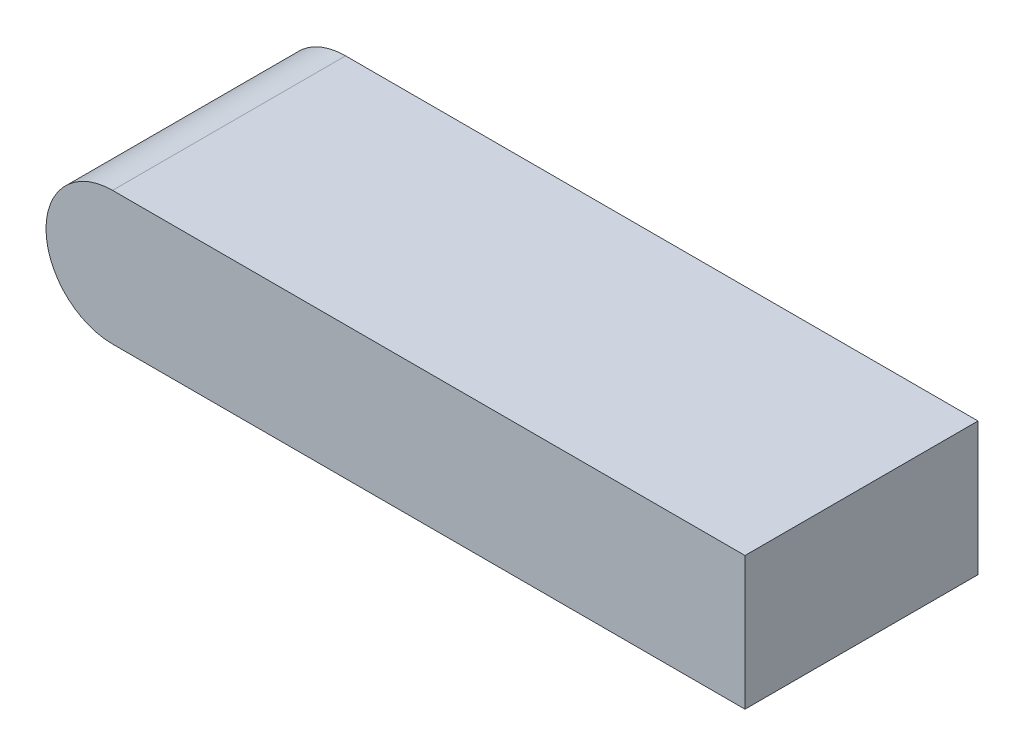
ISO-10303-21;
HEADER;
FILE_DESCRIPTION(('STEP AP214'),'2;1');
FILE_NAME('part.step','',(''),(''),'','','');
FILE_SCHEMA(('AUTOMOTIVE_DESIGN { 1 0 10303 214 1 1 1 1 }'));
ENDSEC;
DATA;
#1=APPLICATION_CONTEXT('core data for automotive mechanical design processes');
#2=APPLICATION_PROTOCOL_DEFINITION('international standard','automotive_design',2000,#1);
#3=PRODUCT_CONTEXT('',#1,'mechanical');
#4=PRODUCT('Part','Part','',(#3));
#5=PRODUCT_RELATED_PRODUCT_CATEGORY('part','',(#4));
#6=PRODUCT_DEFINITION_FORMATION('','',#4);
#7=PRODUCT_DEFINITION_CONTEXT('part definition',#1,'design');
#8=PRODUCT_DEFINITION('design','',#6,#7);
#9=PRODUCT_DEFINITION_SHAPE('','',#8);
#10=(LENGTH_UNIT() NAMED_UNIT(*) SI_UNIT(.MILLI.,.METRE.));
#11=(NAMED_UNIT(*) PLANE_ANGLE_UNIT() SI_UNIT($,.RADIAN.));
#12=(NAMED_UNIT(*) SI_UNIT($,.STERADIAN.) SOLID_ANGLE_UNIT());
#13=UNCERTAINTY_MEASURE_WITH_UNIT(LENGTH_MEASURE(1.E-05),#10,'distance_accuracy_value','');
#14=(GEOMETRIC_REPRESENTATION_CONTEXT(3) GLOBAL_UNCERTAINTY_ASSIGNED_CONTEXT((#13)) GLOBAL_UNIT_ASSIGNED_CONTEXT((#10,
#11,#12)) REPRESENTATION_CONTEXT('',''));
#15=CARTESIAN_POINT('',(0.,0.,0.));
#16=DIRECTION('',(0.,0.,1.));
#17=DIRECTION('',(1.,0.,0.));
#18=AXIS2_PLACEMENT_3D('',#15,#16,#17);
#19=CARTESIAN_POINT('',(-43.18,-10.16,-17.78));
#20=DIRECTION('',(0.,0.,1.));
#21=DIRECTION('',(1.,0.,0.));
#22=AXIS2_PLACEMENT_3D('',#19,#20,#21);
#23=CYLINDRICAL_SURFACE('',#22,10.16);
#24=DIRECTION('',(0.,0.,1.));
#25=VECTOR('',#24,1.);
#26=CARTESIAN_POINT('',(-43.18,0.,0.));
#27=LINE('',#26,#25);
#28=CARTESIAN_POINT('',(-43.18,0.,-17.78));
#29=VERTEX_POINT('',#28);
#30=CARTESIAN_POINT('',(-43.18,0.,17.78));
#31=VERTEX_POINT('',#30);
#32=EDGE_CURVE('E104',#29,#31,#27,.T.);
#33=ORIENTED_EDGE('',*,*,#32,.F.);
#34=CARTESIAN_POINT('',(-43.18,-10.16,-17.78));
#35=DIRECTION('',(0.,0.,-1.));
#36=DIRECTION('',(-1.,0.,0.));
#37=AXIS2_PLACEMENT_3D('',#34,#35,#36);
#38=CIRCLE('',#37,10.16);
#39=CARTESIAN_POINT('',(-43.18,-20.32,-17.78));
#40=VERTEX_POINT('',#39);
#41=EDGE_CURVE('E43',#40,#29,#38,.T.);
#42=ORIENTED_EDGE('',*,*,#41,.F.);
#43=DIRECTION('',(0.,0.,-1.));
#44=VECTOR('',#43,1.);
#45=CARTESIAN_POINT('',(-43.18,-20.32,-17.78));
#46=LINE('',#45,#44);
#47=CARTESIAN_POINT('',(-43.18,-20.32,17.78));
#48=VERTEX_POINT('',#47);
#49=EDGE_CURVE('E91',#48,#40,#46,.T.);
#50=ORIENTED_EDGE('',*,*,#49,.F.);
#51=CARTESIAN_POINT('',(-43.18,-10.16,17.78));
#52=DIRECTION('',(0.,0.,1.));
#53=DIRECTION('',(1.,0.,0.));
#54=AXIS2_PLACEMENT_3D('',#51,#52,#53);
#55=CIRCLE('',#54,10.16);
#56=EDGE_CURVE('E11',#31,#48,#55,.T.);
#57=ORIENTED_EDGE('',*,*,#56,.F.);
#58=EDGE_LOOP('',(#33,#42,#50,#57));
#59=FACE_BOUND('',#58,.T.);
#60=ADVANCED_FACE('F35',(#59),#23,.T.);
#61=CARTESIAN_POINT('',(53.34,-20.32,-17.78));
#62=DIRECTION('',(1.,0.,0.));
#63=DIRECTION('',(0.,0.,-1.));
#64=AXIS2_PLACEMENT_3D('',#61,#62,#63);
#65=PLANE('',#64);
#66=DIRECTION('',(0.,0.,-1.));
#67=VECTOR('',#66,1.);
#68=CARTESIAN_POINT('',(53.34,0.,-17.78));
#69=LINE('',#68,#67);
#70=CARTESIAN_POINT('',(53.34,0.,17.78));
#71=VERTEX_POINT('',#70);
#72=CARTESIAN_POINT('',(53.34,0.,-17.78));
#73=VERTEX_POINT('',#72);
#74=EDGE_CURVE('E101',#71,#73,#69,.T.);
#75=ORIENTED_EDGE('',*,*,#74,.F.);
#76=DIRECTION('',(0.,1.,0.));
#77=VECTOR('',#76,1.);
#78=CARTESIAN_POINT('',(53.34,-20.32,17.78));
#79=LINE('',#78,#77);
#80=CARTESIAN_POINT('',(53.34,-20.32,17.78));
#81=VERTEX_POINT('',#80);
#82=EDGE_CURVE('E83',#81,#71,#79,.T.);
#83=ORIENTED_EDGE('',*,*,#82,.F.);
#84=DIRECTION('',(0.,0.,-1.));
#85=VECTOR('',#84,1.);
#86=CARTESIAN_POINT('',(53.34,-20.32,-17.78));
#87=LINE('',#86,#85);
#88=CARTESIAN_POINT('',(53.34,-20.32,-17.78));
#89=VERTEX_POINT('',#88);
#90=EDGE_CURVE('E90',#81,#89,#87,.T.);
#91=ORIENTED_EDGE('',*,*,#90,.T.);
#92=DIRECTION('',(0.,1.,0.));
#93=VECTOR('',#92,1.);
#94=CARTESIAN_POINT('',(53.34,-20.32,-17.78));
#95=LINE('',#94,#93);
#96=EDGE_CURVE('E73',#89,#73,#95,.T.);
#97=ORIENTED_EDGE('',*,*,#96,.T.);
#98=EDGE_LOOP('',(#75,#83,#91,#97));
#99=FACE_BOUND('',#98,.T.);
#100=ADVANCED_FACE('F94',(#99),#65,.T.);
#101=CARTESIAN_POINT('',(-53.34,-20.32,17.78));
#102=DIRECTION('',(0.,0.,1.));
#103=DIRECTION('',(1.,0.,0.));
#104=AXIS2_PLACEMENT_3D('',#101,#102,#103);
#105=PLANE('',#104);
#106=DIRECTION('',(1.,0.,0.));
#107=VECTOR('',#106,1.);
#108=CARTESIAN_POINT('',(-53.34,0.,17.78));
#109=LINE('',#108,#107);
#110=EDGE_CURVE('E96',#31,#71,#109,.T.);
#111=ORIENTED_EDGE('',*,*,#110,.F.);
#112=ORIENTED_EDGE('',*,*,#56,.T.);
#113=DIRECTION('',(1.,0.,0.));
#114=VECTOR('',#113,1.);
#115=CARTESIAN_POINT('',(-53.34,-20.32,17.78));
#116=LINE('',#115,#114);
#117=EDGE_CURVE('E84',#48,#81,#116,.T.);
#118=ORIENTED_EDGE('',*,*,#117,.T.);
#119=ORIENTED_EDGE('',*,*,#82,.T.);
#120=EDGE_LOOP('',(#111,#112,#118,#119));
#121=FACE_BOUND('',#120,.T.);
#122=ADVANCED_FACE('F110',(#121),#105,.T.);
#123=CARTESIAN_POINT('',(-53.34,-20.32,-17.78));
#124=DIRECTION('',(0.,0.,-1.));
#125=DIRECTION('',(-1.,0.,0.));
#126=AXIS2_PLACEMENT_3D('',#123,#124,#125);
#127=PLANE('',#126);
#128=DIRECTION('',(-1.,0.,0.));
#129=VECTOR('',#128,1.);
#130=CARTESIAN_POINT('',(-53.34,-20.32,-17.78));
#131=LINE('',#130,#129);
#132=EDGE_CURVE('E76',#89,#40,#131,.T.);
#133=ORIENTED_EDGE('',*,*,#132,.T.);
#134=ORIENTED_EDGE('',*,*,#41,.T.);
#135=DIRECTION('',(-1.,0.,0.));
#136=VECTOR('',#135,1.);
#137=CARTESIAN_POINT('',(-53.34,0.,-17.78));
#138=LINE('',#137,#136);
#139=EDGE_CURVE('E78',#73,#29,#138,.T.);
#140=ORIENTED_EDGE('',*,*,#139,.F.);
#141=ORIENTED_EDGE('',*,*,#96,.F.);
#142=EDGE_LOOP('',(#133,#134,#140,#141));
#143=FACE_BOUND('',#142,.T.);
#144=ADVANCED_FACE('F75',(#143),#127,.T.);
#145=CARTESIAN_POINT('',(0.,-20.32,0.));
#146=DIRECTION('',(0.,1.,0.));
#147=DIRECTION('',(0.,0.,1.));
#148=AXIS2_PLACEMENT_3D('',#145,#146,#147);
#149=PLANE('',#148);
#150=ORIENTED_EDGE('',*,*,#117,.F.);
#151=ORIENTED_EDGE('',*,*,#49,.T.);
#152=ORIENTED_EDGE('',*,*,#132,.F.);
#153=ORIENTED_EDGE('',*,*,#90,.F.);
#154=EDGE_LOOP('',(#150,#151,#152,#153));
#155=FACE_BOUND('',#154,.T.);
#156=ADVANCED_FACE('F89',(#155),#149,.F.);
#157=CARTESIAN_POINT('',(0.,0.,0.));
#158=DIRECTION('',(0.,1.,0.));
#159=DIRECTION('',(0.,0.,1.));
#160=AXIS2_PLACEMENT_3D('',#157,#158,#159);
#161=PLANE('',#160);
#162=ORIENTED_EDGE('',*,*,#139,.T.);
#163=ORIENTED_EDGE('',*,*,#32,.T.);
#164=ORIENTED_EDGE('',*,*,#110,.T.);
#165=ORIENTED_EDGE('',*,*,#74,.T.);
#166=EDGE_LOOP('',(#162,#163,#164,#165));
#167=FACE_BOUND('',#166,.T.);
#168=ADVANCED_FACE('F109',(#167),#161,.T.);
#169=CLOSED_SHELL('',(#60,#100,#122,#144,#156,#168));
#170=MANIFOLD_SOLID_BREP('B2',#169);
#171=ADVANCED_BREP_SHAPE_REPRESENTATION('',(#18,#170),#14);
#172=SHAPE_DEFINITION_REPRESENTATION(#9,#171);
ENDSEC;
END-ISO-10303-21;
